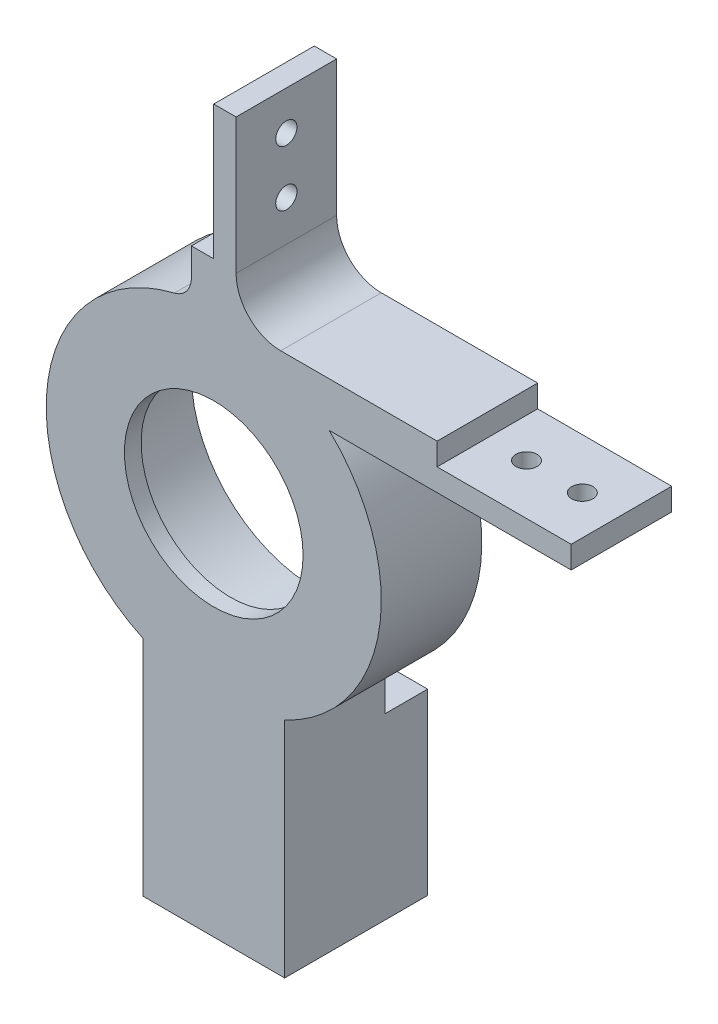
ISO-10303-21;
HEADER;
FILE_DESCRIPTION(('STEP AP214'),'2;1');
FILE_NAME('part.step','',(''),(''),'','','');
FILE_SCHEMA(('AUTOMOTIVE_DESIGN { 1 0 10303 214 1 1 1 1 }'));
ENDSEC;
DATA;
#1=APPLICATION_CONTEXT('core data for automotive mechanical design processes');
#2=APPLICATION_PROTOCOL_DEFINITION('international standard','automotive_design',2000,#1);
#3=PRODUCT_CONTEXT('',#1,'mechanical');
#4=PRODUCT('Part','Part','',(#3));
#5=PRODUCT_RELATED_PRODUCT_CATEGORY('part','',(#4));
#6=PRODUCT_DEFINITION_FORMATION('','',#4);
#7=PRODUCT_DEFINITION_CONTEXT('part definition',#1,'design');
#8=PRODUCT_DEFINITION('design','',#6,#7);
#9=PRODUCT_DEFINITION_SHAPE('','',#8);
#10=(LENGTH_UNIT() NAMED_UNIT(*) SI_UNIT(.MILLI.,.METRE.));
#11=(NAMED_UNIT(*) PLANE_ANGLE_UNIT() SI_UNIT($,.RADIAN.));
#12=(NAMED_UNIT(*) SI_UNIT($,.STERADIAN.) SOLID_ANGLE_UNIT());
#13=UNCERTAINTY_MEASURE_WITH_UNIT(LENGTH_MEASURE(1.E-05),#10,'distance_accuracy_value','');
#14=(GEOMETRIC_REPRESENTATION_CONTEXT(3) GLOBAL_UNCERTAINTY_ASSIGNED_CONTEXT((#13)) GLOBAL_UNIT_ASSIGNED_CONTEXT((#10,
#11,#12)) REPRESENTATION_CONTEXT('',''));
#15=CARTESIAN_POINT('',(0.,0.,0.));
#16=DIRECTION('',(0.,0.,1.));
#17=DIRECTION('',(1.,0.,0.));
#18=AXIS2_PLACEMENT_3D('',#15,#16,#17);
#19=CARTESIAN_POINT('',(0.,0.,9.));
#20=DIRECTION('',(0.,0.,-1.));
#21=DIRECTION('',(-1.,0.,0.));
#22=AXIS2_PLACEMENT_3D('',#19,#20,#21);
#23=CYLINDRICAL_SURFACE('',#22,15.);
#24=CARTESIAN_POINT('',(0.,0.,9.));
#25=DIRECTION('',(0.,0.,1.));
#26=DIRECTION('',(1.,0.,0.));
#27=AXIS2_PLACEMENT_3D('',#24,#25,#26);
#28=CIRCLE('',#27,15.);
#29=CARTESIAN_POINT('',(-3.52941176470588,14.5788632134044,9.));
#30=VERTEX_POINT('',#29);
#31=CARTESIAN_POINT('',(-6.35,-13.5896100017624,9.));
#32=VERTEX_POINT('',#31);
#33=EDGE_CURVE('E287',#30,#32,#28,.T.);
#34=ORIENTED_EDGE('',*,*,#33,.F.);
#35=DIRECTION('',(0.,0.,-1.));
#36=VECTOR('',#35,1.);
#37=CARTESIAN_POINT('',(-3.52941176470588,14.5788632134044,9.));
#38=LINE('',#37,#36);
#39=CARTESIAN_POINT('',(-3.52941176470588,14.5788632134044,0.));
#40=VERTEX_POINT('',#39);
#41=EDGE_CURVE('E300',#30,#40,#38,.T.);
#42=ORIENTED_EDGE('',*,*,#41,.T.);
#43=CARTESIAN_POINT('',(0.,0.,0.));
#44=DIRECTION('',(0.,0.,1.));
#45=DIRECTION('',(1.,0.,0.));
#46=AXIS2_PLACEMENT_3D('',#43,#44,#45);
#47=CIRCLE('',#46,15.);
#48=CARTESIAN_POINT('',(-6.35,-13.5896100017624,0.));
#49=VERTEX_POINT('',#48);
#50=EDGE_CURVE('E283',#40,#49,#47,.T.);
#51=ORIENTED_EDGE('',*,*,#50,.T.);
#52=DIRECTION('',(0.,0.,-1.));
#53=VECTOR('',#52,1.);
#54=CARTESIAN_POINT('',(-6.35,-13.5896100017624,9.));
#55=LINE('',#54,#53);
#56=EDGE_CURVE('E274',#32,#49,#55,.T.);
#57=ORIENTED_EDGE('',*,*,#56,.F.);
#58=EDGE_LOOP('',(#34,#42,#51,#57));
#59=FACE_BOUND('',#58,.T.);
#60=ADVANCED_FACE('F39',(#59),#23,.T.);
#61=DIRECTION('',(0.,0.,-1.));
#62=VECTOR('',#61,1.);
#63=CARTESIAN_POINT('',(10.3406261888992,10.8660687473185,9.));
#64=LINE('',#63,#62);
#65=CARTESIAN_POINT('',(10.3406261888992,10.8660687473185,9.));
#66=VERTEX_POINT('',#65);
#67=CARTESIAN_POINT('',(10.3406261888992,10.8660687473185,0.));
#68=VERTEX_POINT('',#67);
#69=EDGE_CURVE('E203',#66,#68,#64,.T.);
#70=ORIENTED_EDGE('',*,*,#69,.F.);
#71=CARTESIAN_POINT('',(6.35,-13.5896100017624,9.));
#72=VERTEX_POINT('',#71);
#73=EDGE_CURVE('E284',#72,#66,#28,.T.);
#74=ORIENTED_EDGE('',*,*,#73,.F.);
#75=DIRECTION('',(0.,0.,-1.));
#76=VECTOR('',#75,1.);
#77=CARTESIAN_POINT('',(6.35,-13.5896100017624,9.));
#78=LINE('',#77,#76);
#79=CARTESIAN_POINT('',(6.35,-13.5896100017624,0.));
#80=VERTEX_POINT('',#79);
#81=EDGE_CURVE('E277',#72,#80,#78,.T.);
#82=ORIENTED_EDGE('',*,*,#81,.T.);
#83=EDGE_CURVE('E288',#80,#68,#47,.T.);
#84=ORIENTED_EDGE('',*,*,#83,.T.);
#85=EDGE_LOOP('',(#70,#74,#82,#84));
#86=FACE_BOUND('',#85,.T.);
#87=ADVANCED_FACE('F403',(#86),#23,.T.);
#88=CARTESIAN_POINT('',(0.,0.,9.));
#89=DIRECTION('',(0.,0.,-1.));
#90=DIRECTION('',(-1.,0.,0.));
#91=AXIS2_PLACEMENT_3D('',#88,#89,#90);
#92=CYLINDRICAL_SURFACE('',#91,11.);
#93=CARTESIAN_POINT('',(0.,0.,0.));
#94=DIRECTION('',(0.,0.,1.));
#95=DIRECTION('',(1.,0.,0.));
#96=AXIS2_PLACEMENT_3D('',#93,#94,#95);
#97=CIRCLE('',#96,11.);
#98=CARTESIAN_POINT('',(11.,0.,0.));
#99=VERTEX_POINT('',#98);
#100=EDGE_CURVE('E280',#99,#99,#97,.T.);
#101=ORIENTED_EDGE('',*,*,#100,.F.);
#102=EDGE_LOOP('',(#101));
#103=FACE_BOUND('',#102,.T.);
#104=CARTESIAN_POINT('',(0.,0.,7.5));
#105=DIRECTION('',(0.,0.,1.));
#106=DIRECTION('',(1.,0.,0.));
#107=AXIS2_PLACEMENT_3D('',#104,#105,#106);
#108=CIRCLE('',#107,11.);
#109=CARTESIAN_POINT('',(11.,0.,7.5));
#110=VERTEX_POINT('',#109);
#111=EDGE_CURVE('E230',#110,#110,#108,.T.);
#112=ORIENTED_EDGE('',*,*,#111,.T.);
#113=EDGE_LOOP('',(#112));
#114=FACE_BOUND('',#113,.T.);
#115=ADVANCED_FACE('F437',(#103,#114),#92,.F.);
#116=CARTESIAN_POINT('',(0.,0.,9.));
#117=DIRECTION('',(0.,0.,1.));
#118=DIRECTION('',(1.,0.,0.));
#119=AXIS2_PLACEMENT_3D('',#116,#117,#118);
#120=PLANE('',#119);
#121=DIRECTION('',(1.,0.,0.));
#122=VECTOR('',#121,1.);
#123=CARTESIAN_POINT('',(32.,12.8660687473185,9.));
#124=LINE('',#123,#122);
#125=CARTESIAN_POINT('',(20.,12.8660687473185,9.));
#126=VERTEX_POINT('',#125);
#127=CARTESIAN_POINT('',(32.,12.8660687473185,9.));
#128=VERTEX_POINT('',#127);
#129=EDGE_CURVE('E194',#126,#128,#124,.T.);
#130=ORIENTED_EDGE('',*,*,#129,.F.);
#131=DIRECTION('',(0.,-1.,0.));
#132=VECTOR('',#131,1.);
#133=CARTESIAN_POINT('',(20.,14.8660687473185,9.));
#134=LINE('',#133,#132);
#135=CARTESIAN_POINT('',(20.,14.8660687473185,9.));
#136=VERTEX_POINT('',#135);
#137=EDGE_CURVE('E176',#136,#126,#134,.T.);
#138=ORIENTED_EDGE('',*,*,#137,.F.);
#139=DIRECTION('',(-1.,0.,0.));
#140=VECTOR('',#139,1.);
#141=CARTESIAN_POINT('',(2.00000000000001,14.8660687473185,9.));
#142=LINE('',#141,#140);
#143=CARTESIAN_POINT('',(6.00000000000001,14.8660687473185,9.));
#144=VERTEX_POINT('',#143);
#145=EDGE_CURVE('E191',#136,#144,#142,.T.);
#146=ORIENTED_EDGE('',*,*,#145,.T.);
#147=CARTESIAN_POINT('',(6.00000000000001,18.8660687473185,9.));
#148=DIRECTION('',(0.,0.,1.));
#149=DIRECTION('',(1.,0.,0.));
#150=AXIS2_PLACEMENT_3D('',#147,#148,#149);
#151=CIRCLE('',#150,4.);
#152=CARTESIAN_POINT('',(2.00000000000001,18.8660687473185,9.));
#153=VERTEX_POINT('',#152);
#154=EDGE_CURVE('E298',#144,#153,#151,.F.);
#155=ORIENTED_EDGE('',*,*,#154,.T.);
#156=DIRECTION('',(0.,1.,0.));
#157=VECTOR('',#156,1.);
#158=CARTESIAN_POINT('',(2.00000000000001,31.,9.));
#159=LINE('',#158,#157);
#160=CARTESIAN_POINT('',(2.00000000000001,31.,9.));
#161=VERTEX_POINT('',#160);
#162=EDGE_CURVE('E200',#153,#161,#159,.T.);
#163=ORIENTED_EDGE('',*,*,#162,.T.);
#164=DIRECTION('',(-1.,0.,0.));
#165=VECTOR('',#164,1.);
#166=CARTESIAN_POINT('',(-1.99999999999999,31.,9.));
#167=LINE('',#166,#165);
#168=CARTESIAN_POINT('',(0.,31.,9.));
#169=VERTEX_POINT('',#168);
#170=EDGE_CURVE('E212',#161,#169,#167,.T.);
#171=ORIENTED_EDGE('',*,*,#170,.T.);
#172=DIRECTION('',(0.,1.,0.));
#173=VECTOR('',#172,1.);
#174=CARTESIAN_POINT('',(0.,31.,9.));
#175=LINE('',#174,#173);
#176=CARTESIAN_POINT('',(0.,19.,9.));
#177=VERTEX_POINT('',#176);
#178=EDGE_CURVE('E352',#177,#169,#175,.T.);
#179=ORIENTED_EDGE('',*,*,#178,.F.);
#180=DIRECTION('',(1.,0.,0.));
#181=VECTOR('',#180,1.);
#182=CARTESIAN_POINT('',(-1.99999999999999,19.,9.));
#183=LINE('',#182,#181);
#184=CARTESIAN_POINT('',(-1.99999999999999,19.,9.));
#185=VERTEX_POINT('',#184);
#186=EDGE_CURVE('E338',#185,#177,#183,.T.);
#187=ORIENTED_EDGE('',*,*,#186,.F.);
#188=DIRECTION('',(0.,-1.,0.));
#189=VECTOR('',#188,1.);
#190=CARTESIAN_POINT('',(-1.99999999999999,31.,9.));
#191=LINE('',#190,#189);
#192=CARTESIAN_POINT('',(-1.99999999999999,16.5227116418583,9.));
#193=VERTEX_POINT('',#192);
#194=EDGE_CURVE('E210',#185,#193,#191,.T.);
#195=ORIENTED_EDGE('',*,*,#194,.T.);
#196=CARTESIAN_POINT('',(-3.99999999999999,16.5227116418583,9.));
#197=DIRECTION('',(0.,0.,1.));
#198=DIRECTION('',(1.,0.,0.));
#199=AXIS2_PLACEMENT_3D('',#196,#197,#198);
#200=CIRCLE('',#199,2.);
#201=EDGE_CURVE('E12',#193,#30,#200,.F.);
#202=ORIENTED_EDGE('',*,*,#201,.T.);
#203=ORIENTED_EDGE('',*,*,#33,.T.);
#204=DIRECTION('',(0.,-1.,0.));
#205=VECTOR('',#204,1.);
#206=CARTESIAN_POINT('',(-6.35,-13.5896100017624,9.));
#207=LINE('',#206,#205);
#208=CARTESIAN_POINT('',(-6.35,-33.5896100017624,9.));
#209=VERTEX_POINT('',#208);
#210=EDGE_CURVE('E262',#32,#209,#207,.T.);
#211=ORIENTED_EDGE('',*,*,#210,.T.);
#212=DIRECTION('',(1.,0.,0.));
#213=VECTOR('',#212,1.);
#214=CARTESIAN_POINT('',(-6.35,-33.5896100017624,9.));
#215=LINE('',#214,#213);
#216=CARTESIAN_POINT('',(6.35,-33.5896100017624,9.));
#217=VERTEX_POINT('',#216);
#218=EDGE_CURVE('E265',#209,#217,#215,.T.);
#219=ORIENTED_EDGE('',*,*,#218,.T.);
#220=DIRECTION('',(0.,1.,0.));
#221=VECTOR('',#220,1.);
#222=CARTESIAN_POINT('',(6.35,-13.5896100017624,9.));
#223=LINE('',#222,#221);
#224=EDGE_CURVE('E259',#217,#72,#223,.T.);
#225=ORIENTED_EDGE('',*,*,#224,.T.);
#226=ORIENTED_EDGE('',*,*,#73,.T.);
#227=DIRECTION('',(1.,0.,0.));
#228=VECTOR('',#227,1.);
#229=CARTESIAN_POINT('',(2.00000000000001,10.8660687473185,9.));
#230=LINE('',#229,#228);
#231=CARTESIAN_POINT('',(32.,10.8660687473185,9.));
#232=VERTEX_POINT('',#231);
#233=EDGE_CURVE('E205',#66,#232,#230,.T.);
#234=ORIENTED_EDGE('',*,*,#233,.T.);
#235=DIRECTION('',(0.,1.,0.));
#236=VECTOR('',#235,1.);
#237=CARTESIAN_POINT('',(32.,14.8660687473185,9.));
#238=LINE('',#237,#236);
#239=EDGE_CURVE('E201',#232,#128,#238,.T.);
#240=ORIENTED_EDGE('',*,*,#239,.T.);
#241=EDGE_LOOP('',(#130,#138,#146,#155,#163,#171,#179,#187,#195,#202,#203,#211,#219,#225,#226,
#234,#240));
#242=FACE_BOUND('',#241,.T.);
#243=CARTESIAN_POINT('',(0.,0.,9.));
#244=DIRECTION('',(0.,0.,1.));
#245=DIRECTION('',(1.,0.,0.));
#246=AXIS2_PLACEMENT_3D('',#243,#244,#245);
#247=CIRCLE('',#246,8.);
#248=CARTESIAN_POINT('',(8.,0.,9.));
#249=VERTEX_POINT('',#248);
#250=EDGE_CURVE('E226',#249,#249,#247,.T.);
#251=ORIENTED_EDGE('',*,*,#250,.F.);
#252=EDGE_LOOP('',(#251));
#253=FACE_BOUND('',#252,.T.);
#254=ADVANCED_FACE('F189',(#242,#253),#120,.T.);
#255=CARTESIAN_POINT('',(0.,0.,0.));
#256=DIRECTION('',(0.,0.,1.));
#257=DIRECTION('',(1.,0.,0.));
#258=AXIS2_PLACEMENT_3D('',#255,#256,#257);
#259=PLANE('',#258);
#260=CARTESIAN_POINT('',(0.,15.,0.));
#261=DIRECTION('',(0.,0.,1.));
#262=DIRECTION('',(1.,0.,0.));
#263=AXIS2_PLACEMENT_3D('',#260,#261,#262);
#264=CIRCLE('',#263,0.95);
#265=CARTESIAN_POINT('',(0.949999999999999,15.,0.));
#266=VERTEX_POINT('',#265);
#267=EDGE_CURVE('E43',#266,#266,#264,.T.);
#268=ORIENTED_EDGE('',*,*,#267,.T.);
#269=EDGE_LOOP('',(#268));
#270=FACE_BOUND('',#269,.T.);
#271=CARTESIAN_POINT('',(0.,-15.,0.));
#272=DIRECTION('',(0.,0.,1.));
#273=DIRECTION('',(1.,0.,0.));
#274=AXIS2_PLACEMENT_3D('',#271,#272,#273);
#275=CIRCLE('',#274,0.95);
#276=CARTESIAN_POINT('',(0.949999999999995,-15.,0.));
#277=VERTEX_POINT('',#276);
#278=EDGE_CURVE('E304',#277,#277,#275,.T.);
#279=ORIENTED_EDGE('',*,*,#278,.T.);
#280=EDGE_LOOP('',(#279));
#281=FACE_BOUND('',#280,.T.);
#282=DIRECTION('',(0.,-1.,0.));
#283=VECTOR('',#282,1.);
#284=CARTESIAN_POINT('',(20.,0.,0.));
#285=LINE('',#284,#283);
#286=CARTESIAN_POINT('',(20.,14.8660687473185,0.));
#287=VERTEX_POINT('',#286);
#288=CARTESIAN_POINT('',(20.,12.8660687473185,0.));
#289=VERTEX_POINT('',#288);
#290=EDGE_CURVE('E179',#287,#289,#285,.T.);
#291=ORIENTED_EDGE('',*,*,#290,.T.);
#292=DIRECTION('',(1.,0.,0.));
#293=VECTOR('',#292,1.);
#294=CARTESIAN_POINT('',(0.,12.8660687473185,0.));
#295=LINE('',#294,#293);
#296=CARTESIAN_POINT('',(32.,12.8660687473185,0.));
#297=VERTEX_POINT('',#296);
#298=EDGE_CURVE('E360',#289,#297,#295,.T.);
#299=ORIENTED_EDGE('',*,*,#298,.T.);
#300=DIRECTION('',(0.,1.,0.));
#301=VECTOR('',#300,1.);
#302=CARTESIAN_POINT('',(32.,14.8660687473185,0.));
#303=LINE('',#302,#301);
#304=CARTESIAN_POINT('',(32.,10.8660687473185,0.));
#305=VERTEX_POINT('',#304);
#306=EDGE_CURVE('E219',#305,#297,#303,.T.);
#307=ORIENTED_EDGE('',*,*,#306,.F.);
#308=DIRECTION('',(1.,0.,0.));
#309=VECTOR('',#308,1.);
#310=CARTESIAN_POINT('',(2.00000000000001,10.8660687473185,0.));
#311=LINE('',#310,#309);
#312=EDGE_CURVE('E220',#68,#305,#311,.T.);
#313=ORIENTED_EDGE('',*,*,#312,.F.);
#314=ORIENTED_EDGE('',*,*,#83,.F.);
#315=DIRECTION('',(0.,1.,0.));
#316=VECTOR('',#315,1.);
#317=CARTESIAN_POINT('',(6.35,-13.5896100017624,0.));
#318=LINE('',#317,#316);
#319=CARTESIAN_POINT('',(6.35,-17.5896100017624,0.));
#320=VERTEX_POINT('',#319);
#321=EDGE_CURVE('E258',#320,#80,#318,.T.);
#322=ORIENTED_EDGE('',*,*,#321,.F.);
#323=DIRECTION('',(-1.,0.,0.));
#324=VECTOR('',#323,1.);
#325=CARTESIAN_POINT('',(-6.35,-17.5896100017624,0.));
#326=LINE('',#325,#324);
#327=CARTESIAN_POINT('',(-6.35,-17.5896100017624,0.));
#328=VERTEX_POINT('',#327);
#329=EDGE_CURVE('E239',#320,#328,#326,.T.);
#330=ORIENTED_EDGE('',*,*,#329,.T.);
#331=DIRECTION('',(0.,-1.,0.));
#332=VECTOR('',#331,1.);
#333=CARTESIAN_POINT('',(-6.35,-13.5896100017624,0.));
#334=LINE('',#333,#332);
#335=EDGE_CURVE('E263',#49,#328,#334,.T.);
#336=ORIENTED_EDGE('',*,*,#335,.F.);
#337=ORIENTED_EDGE('',*,*,#50,.F.);
#338=CARTESIAN_POINT('',(-3.99999999999999,16.5227116418583,0.));
#339=DIRECTION('',(0.,0.,1.));
#340=DIRECTION('',(1.,0.,0.));
#341=AXIS2_PLACEMENT_3D('',#338,#339,#340);
#342=CIRCLE('',#341,2.);
#343=CARTESIAN_POINT('',(-1.99999999999999,16.5227116418583,0.));
#344=VERTEX_POINT('',#343);
#345=EDGE_CURVE('E48',#40,#344,#342,.T.);
#346=ORIENTED_EDGE('',*,*,#345,.T.);
#347=DIRECTION('',(0.,-1.,0.));
#348=VECTOR('',#347,1.);
#349=CARTESIAN_POINT('',(-1.99999999999999,31.,0.));
#350=LINE('',#349,#348);
#351=CARTESIAN_POINT('',(-1.99999999999999,19.,0.));
#352=VERTEX_POINT('',#351);
#353=EDGE_CURVE('E366',#352,#344,#350,.T.);
#354=ORIENTED_EDGE('',*,*,#353,.F.);
#355=DIRECTION('',(1.,0.,0.));
#356=VECTOR('',#355,1.);
#357=CARTESIAN_POINT('',(0.,19.,0.));
#358=LINE('',#357,#356);
#359=CARTESIAN_POINT('',(0.,19.,0.));
#360=VERTEX_POINT('',#359);
#361=EDGE_CURVE('E363',#352,#360,#358,.T.);
#362=ORIENTED_EDGE('',*,*,#361,.T.);
#363=DIRECTION('',(0.,1.,0.));
#364=VECTOR('',#363,1.);
#365=CARTESIAN_POINT('',(0.,0.,0.));
#366=LINE('',#365,#364);
#367=CARTESIAN_POINT('',(0.,31.,0.));
#368=VERTEX_POINT('',#367);
#369=EDGE_CURVE('E348',#360,#368,#366,.T.);
#370=ORIENTED_EDGE('',*,*,#369,.T.);
#371=DIRECTION('',(-1.,0.,0.));
#372=VECTOR('',#371,1.);
#373=CARTESIAN_POINT('',(-1.99999999999999,31.,0.));
#374=LINE('',#373,#372);
#375=CARTESIAN_POINT('',(2.00000000000001,31.,0.));
#376=VERTEX_POINT('',#375);
#377=EDGE_CURVE('E215',#376,#368,#374,.T.);
#378=ORIENTED_EDGE('',*,*,#377,.F.);
#379=DIRECTION('',(0.,1.,0.));
#380=VECTOR('',#379,1.);
#381=CARTESIAN_POINT('',(2.00000000000001,31.,0.));
#382=LINE('',#381,#380);
#383=CARTESIAN_POINT('',(2.00000000000001,18.8660687473185,0.));
#384=VERTEX_POINT('',#383);
#385=EDGE_CURVE('E224',#384,#376,#382,.T.);
#386=ORIENTED_EDGE('',*,*,#385,.F.);
#387=CARTESIAN_POINT('',(6.00000000000001,18.8660687473185,0.));
#388=DIRECTION('',(0.,0.,1.));
#389=DIRECTION('',(1.,0.,0.));
#390=AXIS2_PLACEMENT_3D('',#387,#388,#389);
#391=CIRCLE('',#390,4.);
#392=CARTESIAN_POINT('',(6.00000000000001,14.8660687473185,0.));
#393=VERTEX_POINT('',#392);
#394=EDGE_CURVE('E296',#384,#393,#391,.T.);
#395=ORIENTED_EDGE('',*,*,#394,.T.);
#396=DIRECTION('',(-1.,0.,0.));
#397=VECTOR('',#396,1.);
#398=CARTESIAN_POINT('',(2.00000000000001,14.8660687473185,0.));
#399=LINE('',#398,#397);
#400=EDGE_CURVE('E370',#287,#393,#399,.T.);
#401=ORIENTED_EDGE('',*,*,#400,.F.);
#402=EDGE_LOOP('',(#291,#299,#307,#313,#314,#322,#330,#336,#337,#346,#354,#362,#370,#378,#386,
#395,#401));
#403=FACE_BOUND('',#402,.T.);
#404=ORIENTED_EDGE('',*,*,#100,.T.);
#405=EDGE_LOOP('',(#404));
#406=FACE_BOUND('',#405,.T.);
#407=ADVANCED_FACE('F412',(#270,#281,#403,#406),#259,.F.);
#408=CARTESIAN_POINT('',(6.35,-13.5896100017624,9.));
#409=DIRECTION('',(-1.,0.,0.));
#410=DIRECTION('',(0.,-1.,0.));
#411=AXIS2_PLACEMENT_3D('',#408,#409,#410);
#412=PLANE('',#411);
#413=DIRECTION('',(0.,0.,-1.));
#414=VECTOR('',#413,1.);
#415=CARTESIAN_POINT('',(6.35,-33.5896100017624,9.));
#416=LINE('',#415,#414);
#417=CARTESIAN_POINT('',(6.35,-33.5896100017624,-3.80000000000001));
#418=VERTEX_POINT('',#417);
#419=EDGE_CURVE('E267',#217,#418,#416,.T.);
#420=ORIENTED_EDGE('',*,*,#419,.T.);
#421=DIRECTION('',(0.,-1.,0.));
#422=VECTOR('',#421,1.);
#423=CARTESIAN_POINT('',(6.35,-33.5896100017624,-3.8));
#424=LINE('',#423,#422);
#425=CARTESIAN_POINT('',(6.35,-17.5896100017624,-3.8));
#426=VERTEX_POINT('',#425);
#427=EDGE_CURVE('E242',#426,#418,#424,.T.);
#428=ORIENTED_EDGE('',*,*,#427,.F.);
#429=DIRECTION('',(0.,0.,1.));
#430=VECTOR('',#429,1.);
#431=CARTESIAN_POINT('',(6.35,-17.5896100017624,-37.0276773031101));
#432=LINE('',#431,#430);
#433=EDGE_CURVE('E253',#426,#320,#432,.T.);
#434=ORIENTED_EDGE('',*,*,#433,.T.);
#435=ORIENTED_EDGE('',*,*,#321,.T.);
#436=ORIENTED_EDGE('',*,*,#81,.F.);
#437=ORIENTED_EDGE('',*,*,#224,.F.);
#438=EDGE_LOOP('',(#420,#428,#434,#435,#436,#437));
#439=FACE_BOUND('',#438,.T.);
#440=ADVANCED_FACE('F398',(#439),#412,.F.);
#441=CARTESIAN_POINT('',(-6.35,-13.5896100017624,9.));
#442=DIRECTION('',(1.,0.,0.));
#443=DIRECTION('',(0.,1.,0.));
#444=AXIS2_PLACEMENT_3D('',#441,#442,#443);
#445=PLANE('',#444);
#446=ORIENTED_EDGE('',*,*,#335,.T.);
#447=DIRECTION('',(0.,0.,1.));
#448=VECTOR('',#447,1.);
#449=CARTESIAN_POINT('',(-6.35,-17.5896100017624,-37.0276773031101));
#450=LINE('',#449,#448);
#451=CARTESIAN_POINT('',(-6.35,-17.5896100017624,-3.8));
#452=VERTEX_POINT('',#451);
#453=EDGE_CURVE('E246',#452,#328,#450,.T.);
#454=ORIENTED_EDGE('',*,*,#453,.F.);
#455=DIRECTION('',(0.,1.,0.));
#456=VECTOR('',#455,1.);
#457=CARTESIAN_POINT('',(-6.35,-33.5896100017624,-3.8));
#458=LINE('',#457,#456);
#459=CARTESIAN_POINT('',(-6.35,-33.5896100017624,-3.8));
#460=VERTEX_POINT('',#459);
#461=EDGE_CURVE('E248',#460,#452,#458,.T.);
#462=ORIENTED_EDGE('',*,*,#461,.F.);
#463=DIRECTION('',(0.,0.,-1.));
#464=VECTOR('',#463,1.);
#465=CARTESIAN_POINT('',(-6.35,-33.5896100017624,9.));
#466=LINE('',#465,#464);
#467=EDGE_CURVE('E272',#209,#460,#466,.T.);
#468=ORIENTED_EDGE('',*,*,#467,.F.);
#469=ORIENTED_EDGE('',*,*,#210,.F.);
#470=ORIENTED_EDGE('',*,*,#56,.T.);
#471=EDGE_LOOP('',(#446,#454,#462,#468,#469,#470));
#472=FACE_BOUND('',#471,.T.);
#473=ADVANCED_FACE('F387',(#472),#445,.F.);
#474=CARTESIAN_POINT('',(-6.35,-33.5896100017624,9.));
#475=DIRECTION('',(0.,1.,0.));
#476=DIRECTION('',(-1.,0.,0.));
#477=AXIS2_PLACEMENT_3D('',#474,#475,#476);
#478=PLANE('',#477);
#479=CARTESIAN_POINT('',(0.,-33.5896100017624,2.59999999999999));
#480=DIRECTION('',(0.,-1.,0.));
#481=DIRECTION('',(1.,0.,0.));
#482=AXIS2_PLACEMENT_3D('',#479,#480,#481);
#483=CIRCLE('',#482,1.275);
#484=CARTESIAN_POINT('',(1.27500000000002,-33.5896100017624,2.59999999999999));
#485=VERTEX_POINT('',#484);
#486=EDGE_CURVE('E235',#485,#485,#483,.T.);
#487=ORIENTED_EDGE('',*,*,#486,.F.);
#488=EDGE_LOOP('',(#487));
#489=FACE_BOUND('',#488,.T.);
#490=ORIENTED_EDGE('',*,*,#467,.T.);
#491=DIRECTION('',(-1.,0.,0.));
#492=VECTOR('',#491,1.);
#493=CARTESIAN_POINT('',(-6.35,-33.5896100017624,-3.8));
#494=LINE('',#493,#492);
#495=EDGE_CURVE('E250',#418,#460,#494,.T.);
#496=ORIENTED_EDGE('',*,*,#495,.F.);
#497=ORIENTED_EDGE('',*,*,#419,.F.);
#498=ORIENTED_EDGE('',*,*,#218,.F.);
#499=EDGE_LOOP('',(#490,#496,#497,#498));
#500=FACE_BOUND('',#499,.T.);
#501=ADVANCED_FACE('F395',(#489,#500),#478,.F.);
#502=CARTESIAN_POINT('',(-6.35,-17.5896100017624,-37.0276773031101));
#503=DIRECTION('',(0.,1.,0.));
#504=DIRECTION('',(0.,0.,1.));
#505=AXIS2_PLACEMENT_3D('',#502,#503,#504);
#506=PLANE('',#505);
#507=DIRECTION('',(1.,0.,0.));
#508=VECTOR('',#507,1.);
#509=CARTESIAN_POINT('',(-6.35,-17.5896100017624,-3.8));
#510=LINE('',#509,#508);
#511=EDGE_CURVE('E245',#452,#426,#510,.T.);
#512=ORIENTED_EDGE('',*,*,#511,.F.);
#513=ORIENTED_EDGE('',*,*,#453,.T.);
#514=ORIENTED_EDGE('',*,*,#329,.F.);
#515=ORIENTED_EDGE('',*,*,#433,.F.);
#516=EDGE_LOOP('',(#512,#513,#514,#515));
#517=FACE_BOUND('',#516,.T.);
#518=ADVANCED_FACE('F504',(#517),#506,.T.);
#519=CARTESIAN_POINT('',(0.,0.,-3.8));
#520=DIRECTION('',(0.,0.,1.));
#521=DIRECTION('',(1.,0.,0.));
#522=AXIS2_PLACEMENT_3D('',#519,#520,#521);
#523=PLANE('',#522);
#524=ORIENTED_EDGE('',*,*,#461,.T.);
#525=ORIENTED_EDGE('',*,*,#511,.T.);
#526=ORIENTED_EDGE('',*,*,#427,.T.);
#527=ORIENTED_EDGE('',*,*,#495,.T.);
#528=EDGE_LOOP('',(#524,#525,#526,#527));
#529=FACE_BOUND('',#528,.T.);
#530=ADVANCED_FACE('F500',(#529),#523,.F.);
#531=CARTESIAN_POINT('',(0.,-26.5896100017624,2.59999999999999));
#532=DIRECTION('',(0.,-1.,0.));
#533=DIRECTION('',(1.,0.,0.));
#534=AXIS2_PLACEMENT_3D('',#531,#532,#533);
#535=CYLINDRICAL_SURFACE('',#534,1.275);
#536=CARTESIAN_POINT('',(0.,-26.5896100017624,2.59999999999999));
#537=DIRECTION('',(0.,-1.,0.));
#538=DIRECTION('',(1.,0.,0.));
#539=AXIS2_PLACEMENT_3D('',#536,#537,#538);
#540=CIRCLE('',#539,1.275);
#541=CARTESIAN_POINT('',(1.27500000000001,-26.5896100017624,2.59999999999999));
#542=VERTEX_POINT('',#541);
#543=EDGE_CURVE('E236',#542,#542,#540,.T.);
#544=ORIENTED_EDGE('',*,*,#543,.F.);
#545=EDGE_LOOP('',(#544));
#546=FACE_BOUND('',#545,.T.);
#547=ORIENTED_EDGE('',*,*,#486,.T.);
#548=EDGE_LOOP('',(#547));
#549=FACE_BOUND('',#548,.T.);
#550=ADVANCED_FACE('F496',(#546,#549),#535,.F.);
#551=CARTESIAN_POINT('',(0.,-26.5896100017624,2.59999999999999));
#552=DIRECTION('',(0.,-1.,0.));
#553=DIRECTION('',(1.,0.,0.));
#554=AXIS2_PLACEMENT_3D('',#551,#552,#553);
#555=PLANE('',#554);
#556=ORIENTED_EDGE('',*,*,#543,.T.);
#557=EDGE_LOOP('',(#556));
#558=FACE_BOUND('',#557,.T.);
#559=ADVANCED_FACE('F492',(#558),#555,.T.);
#560=CARTESIAN_POINT('',(0.,0.,7.5));
#561=DIRECTION('',(0.,0.,1.));
#562=DIRECTION('',(1.,0.,0.));
#563=AXIS2_PLACEMENT_3D('',#560,#561,#562);
#564=PLANE('',#563);
#565=CARTESIAN_POINT('',(0.,0.,7.5));
#566=DIRECTION('',(0.,0.,1.));
#567=DIRECTION('',(1.,0.,0.));
#568=AXIS2_PLACEMENT_3D('',#565,#566,#567);
#569=CIRCLE('',#568,8.);
#570=CARTESIAN_POINT('',(8.,0.,7.5));
#571=VERTEX_POINT('',#570);
#572=EDGE_CURVE('E227',#571,#571,#569,.T.);
#573=ORIENTED_EDGE('',*,*,#572,.T.);
#574=EDGE_LOOP('',(#573));
#575=FACE_BOUND('',#574,.T.);
#576=ORIENTED_EDGE('',*,*,#111,.F.);
#577=EDGE_LOOP('',(#576));
#578=FACE_BOUND('',#577,.T.);
#579=ADVANCED_FACE('F488',(#575,#578),#564,.F.);
#580=CARTESIAN_POINT('',(0.,0.,7.5));
#581=DIRECTION('',(0.,0.,1.));
#582=DIRECTION('',(1.,0.,0.));
#583=AXIS2_PLACEMENT_3D('',#580,#581,#582);
#584=CYLINDRICAL_SURFACE('',#583,8.);
#585=ORIENTED_EDGE('',*,*,#572,.F.);
#586=EDGE_LOOP('',(#585));
#587=FACE_BOUND('',#586,.T.);
#588=ORIENTED_EDGE('',*,*,#250,.T.);
#589=EDGE_LOOP('',(#588));
#590=FACE_BOUND('',#589,.T.);
#591=ADVANCED_FACE('F482',(#587,#590),#584,.F.);
#592=CARTESIAN_POINT('',(2.00000000000001,10.8660687473185,48.5142403152042));
#593=DIRECTION('',(0.,1.,0.));
#594=DIRECTION('',(0.,0.,1.));
#595=AXIS2_PLACEMENT_3D('',#592,#593,#594);
#596=PLANE('',#595);
#597=CARTESIAN_POINT('',(23.5,10.8660687473185,4.5));
#598=DIRECTION('',(0.,1.,0.));
#599=DIRECTION('',(0.,0.,1.));
#600=AXIS2_PLACEMENT_3D('',#597,#598,#599);
#601=CIRCLE('',#600,0.950000000000001);
#602=CARTESIAN_POINT('',(23.5,10.8660687473185,5.45));
#603=VERTEX_POINT('',#602);
#604=EDGE_CURVE('E322',#603,#603,#601,.F.);
#605=ORIENTED_EDGE('',*,*,#604,.F.);
#606=EDGE_LOOP('',(#605));
#607=FACE_BOUND('',#606,.T.);
#608=CARTESIAN_POINT('',(28.5,10.8660687473185,4.5));
#609=DIRECTION('',(0.,1.,0.));
#610=DIRECTION('',(0.,0.,1.));
#611=AXIS2_PLACEMENT_3D('',#608,#609,#610);
#612=CIRCLE('',#611,0.950000000000004);
#613=CARTESIAN_POINT('',(28.5,10.8660687473185,5.45000000000001));
#614=VERTEX_POINT('',#613);
#615=EDGE_CURVE('E323',#614,#614,#612,.F.);
#616=ORIENTED_EDGE('',*,*,#615,.F.);
#617=EDGE_LOOP('',(#616));
#618=FACE_BOUND('',#617,.T.);
#619=ORIENTED_EDGE('',*,*,#233,.F.);
#620=ORIENTED_EDGE('',*,*,#69,.T.);
#621=ORIENTED_EDGE('',*,*,#312,.T.);
#622=DIRECTION('',(0.,0.,-1.));
#623=VECTOR('',#622,1.);
#624=CARTESIAN_POINT('',(32.,10.8660687473185,48.5142403152042));
#625=LINE('',#624,#623);
#626=EDGE_CURVE('E216',#232,#305,#625,.T.);
#627=ORIENTED_EDGE('',*,*,#626,.F.);
#628=EDGE_LOOP('',(#619,#620,#621,#627));
#629=FACE_BOUND('',#628,.T.);
#630=ADVANCED_FACE('F410',(#607,#618,#629),#596,.F.);
#631=CARTESIAN_POINT('',(-1.99999999999999,31.,48.5142403152042));
#632=DIRECTION('',(1.,0.,0.));
#633=DIRECTION('',(0.,1.,0.));
#634=AXIS2_PLACEMENT_3D('',#631,#632,#633);
#635=PLANE('',#634);
#636=ORIENTED_EDGE('',*,*,#353,.T.);
#637=DIRECTION('',(0.,0.,1.));
#638=VECTOR('',#637,1.);
#639=CARTESIAN_POINT('',(-1.99999999999999,16.5227116418583,9.));
#640=LINE('',#639,#638);
#641=EDGE_CURVE('E62',#344,#193,#640,.T.);
#642=ORIENTED_EDGE('',*,*,#641,.T.);
#643=ORIENTED_EDGE('',*,*,#194,.F.);
#644=DIRECTION('',(0.,0.,1.));
#645=VECTOR('',#644,1.);
#646=CARTESIAN_POINT('',(-1.99999999999999,19.,-3.80000000000001));
#647=LINE('',#646,#645);
#648=EDGE_CURVE('E354',#352,#185,#647,.T.);
#649=ORIENTED_EDGE('',*,*,#648,.F.);
#650=EDGE_LOOP('',(#636,#642,#643,#649));
#651=FACE_BOUND('',#650,.T.);
#652=ADVANCED_FACE('F375',(#651),#635,.F.);
#653=CARTESIAN_POINT('',(32.,14.8660687473185,48.5142403152042));
#654=DIRECTION('',(-1.,0.,0.));
#655=DIRECTION('',(0.,0.,1.));
#656=AXIS2_PLACEMENT_3D('',#653,#654,#655);
#657=PLANE('',#656);
#658=ORIENTED_EDGE('',*,*,#306,.T.);
#659=DIRECTION('',(0.,0.,1.));
#660=VECTOR('',#659,1.);
#661=CARTESIAN_POINT('',(32.,12.8660687473185,-3.80000000000001));
#662=LINE('',#661,#660);
#663=EDGE_CURVE('E345',#297,#128,#662,.T.);
#664=ORIENTED_EDGE('',*,*,#663,.T.);
#665=ORIENTED_EDGE('',*,*,#239,.F.);
#666=ORIENTED_EDGE('',*,*,#626,.T.);
#667=EDGE_LOOP('',(#658,#664,#665,#666));
#668=FACE_BOUND('',#667,.T.);
#669=ADVANCED_FACE('F408',(#668),#657,.F.);
#670=CARTESIAN_POINT('',(2.00000000000001,14.8660687473185,48.5142403152042));
#671=DIRECTION('',(0.,-1.,0.));
#672=DIRECTION('',(0.,0.,-1.));
#673=AXIS2_PLACEMENT_3D('',#670,#671,#672);
#674=PLANE('',#673);
#675=ORIENTED_EDGE('',*,*,#400,.T.);
#676=DIRECTION('',(0.,0.,-1.));
#677=VECTOR('',#676,1.);
#678=CARTESIAN_POINT('',(6.00000000000001,14.8660687473185,9.));
#679=LINE('',#678,#677);
#680=EDGE_CURVE('E199',#393,#144,#679,.F.);
#681=ORIENTED_EDGE('',*,*,#680,.T.);
#682=ORIENTED_EDGE('',*,*,#145,.F.);
#683=DIRECTION('',(0.,0.,-1.));
#684=VECTOR('',#683,1.);
#685=CARTESIAN_POINT('',(20.,14.8660687473185,48.5142403152042));
#686=LINE('',#685,#684);
#687=EDGE_CURVE('E172',#136,#287,#686,.T.);
#688=ORIENTED_EDGE('',*,*,#687,.T.);
#689=EDGE_LOOP('',(#675,#681,#682,#688));
#690=FACE_BOUND('',#689,.T.);
#691=ADVANCED_FACE('F197',(#690),#674,.F.);
#692=CARTESIAN_POINT('',(2.00000000000001,31.,48.5142403152042));
#693=DIRECTION('',(-1.,0.,0.));
#694=DIRECTION('',(0.,-1.,0.));
#695=AXIS2_PLACEMENT_3D('',#692,#693,#694);
#696=PLANE('',#695);
#697=CARTESIAN_POINT('',(2.00000000000001,27.5,4.5));
#698=DIRECTION('',(-1.,0.,0.));
#699=DIRECTION('',(0.,-1.,0.));
#700=AXIS2_PLACEMENT_3D('',#697,#698,#699);
#701=CIRCLE('',#700,0.949999999999999);
#702=CARTESIAN_POINT('',(2.00000000000001,26.55,4.5));
#703=VERTEX_POINT('',#702);
#704=EDGE_CURVE('E334',#703,#703,#701,.F.);
#705=ORIENTED_EDGE('',*,*,#704,.F.);
#706=EDGE_LOOP('',(#705));
#707=FACE_BOUND('',#706,.T.);
#708=CARTESIAN_POINT('',(2.00000000000001,22.5,4.5));
#709=DIRECTION('',(-1.,0.,0.));
#710=DIRECTION('',(0.,-1.,0.));
#711=AXIS2_PLACEMENT_3D('',#708,#709,#710);
#712=CIRCLE('',#711,0.95);
#713=CARTESIAN_POINT('',(2.00000000000001,21.55,4.5));
#714=VERTEX_POINT('',#713);
#715=EDGE_CURVE('E335',#714,#714,#712,.F.);
#716=ORIENTED_EDGE('',*,*,#715,.F.);
#717=EDGE_LOOP('',(#716));
#718=FACE_BOUND('',#717,.T.);
#719=ORIENTED_EDGE('',*,*,#162,.F.);
#720=DIRECTION('',(0.,0.,-1.));
#721=VECTOR('',#720,1.);
#722=CARTESIAN_POINT('',(2.00000000000001,18.8660687473185,0.));
#723=LINE('',#722,#721);
#724=EDGE_CURVE('E184',#153,#384,#723,.T.);
#725=ORIENTED_EDGE('',*,*,#724,.T.);
#726=ORIENTED_EDGE('',*,*,#385,.T.);
#727=DIRECTION('',(0.,0.,-1.));
#728=VECTOR('',#727,1.);
#729=CARTESIAN_POINT('',(2.00000000000001,31.,48.5142403152042));
#730=LINE('',#729,#728);
#731=EDGE_CURVE('E221',#161,#376,#730,.T.);
#732=ORIENTED_EDGE('',*,*,#731,.F.);
#733=EDGE_LOOP('',(#719,#725,#726,#732));
#734=FACE_BOUND('',#733,.T.);
#735=ADVANCED_FACE('F456',(#707,#718,#734),#696,.F.);
#736=CARTESIAN_POINT('',(-1.99999999999999,31.,48.5142403152042));
#737=DIRECTION('',(0.,-1.,0.));
#738=DIRECTION('',(0.,0.,-1.));
#739=AXIS2_PLACEMENT_3D('',#736,#737,#738);
#740=PLANE('',#739);
#741=ORIENTED_EDGE('',*,*,#377,.T.);
#742=DIRECTION('',(0.,0.,1.));
#743=VECTOR('',#742,1.);
#744=CARTESIAN_POINT('',(0.,31.,48.5142403152042));
#745=LINE('',#744,#743);
#746=EDGE_CURVE('E185',#368,#169,#745,.T.);
#747=ORIENTED_EDGE('',*,*,#746,.T.);
#748=ORIENTED_EDGE('',*,*,#170,.F.);
#749=ORIENTED_EDGE('',*,*,#731,.T.);
#750=EDGE_LOOP('',(#741,#747,#748,#749));
#751=FACE_BOUND('',#750,.T.);
#752=ADVANCED_FACE('F461',(#751),#740,.F.);
#753=CARTESIAN_POINT('',(-1.99999999999999,19.,-3.80000000000001));
#754=DIRECTION('',(0.,-1.,0.));
#755=DIRECTION('',(0.,0.,-1.));
#756=AXIS2_PLACEMENT_3D('',#753,#754,#755);
#757=PLANE('',#756);
#758=ORIENTED_EDGE('',*,*,#648,.T.);
#759=ORIENTED_EDGE('',*,*,#186,.T.);
#760=DIRECTION('',(0.,0.,1.));
#761=VECTOR('',#760,1.);
#762=CARTESIAN_POINT('',(0.,19.,-3.80000000000001));
#763=LINE('',#762,#761);
#764=EDGE_CURVE('E195',#360,#177,#763,.T.);
#765=ORIENTED_EDGE('',*,*,#764,.F.);
#766=ORIENTED_EDGE('',*,*,#361,.F.);
#767=EDGE_LOOP('',(#758,#759,#765,#766));
#768=FACE_BOUND('',#767,.T.);
#769=ADVANCED_FACE('F426',(#768),#757,.F.);
#770=CARTESIAN_POINT('',(0.,31.,-3.80000000000001));
#771=DIRECTION('',(1.,0.,0.));
#772=DIRECTION('',(0.,1.,0.));
#773=AXIS2_PLACEMENT_3D('',#770,#771,#772);
#774=PLANE('',#773);
#775=CARTESIAN_POINT('',(0.,27.5,4.5));
#776=DIRECTION('',(-1.,0.,0.));
#777=DIRECTION('',(0.,-1.,0.));
#778=AXIS2_PLACEMENT_3D('',#775,#776,#777);
#779=CIRCLE('',#778,0.949999999999999);
#780=CARTESIAN_POINT('',(0.,26.55,4.5));
#781=VERTEX_POINT('',#780);
#782=EDGE_CURVE('E331',#781,#781,#779,.T.);
#783=ORIENTED_EDGE('',*,*,#782,.F.);
#784=EDGE_LOOP('',(#783));
#785=FACE_BOUND('',#784,.T.);
#786=CARTESIAN_POINT('',(0.,22.5,4.5));
#787=DIRECTION('',(-1.,0.,0.));
#788=DIRECTION('',(0.,-1.,0.));
#789=AXIS2_PLACEMENT_3D('',#786,#787,#788);
#790=CIRCLE('',#789,0.95);
#791=CARTESIAN_POINT('',(0.,21.55,4.5));
#792=VERTEX_POINT('',#791);
#793=EDGE_CURVE('E326',#792,#792,#790,.T.);
#794=ORIENTED_EDGE('',*,*,#793,.F.);
#795=EDGE_LOOP('',(#794));
#796=FACE_BOUND('',#795,.T.);
#797=ORIENTED_EDGE('',*,*,#764,.T.);
#798=ORIENTED_EDGE('',*,*,#178,.T.);
#799=ORIENTED_EDGE('',*,*,#746,.F.);
#800=ORIENTED_EDGE('',*,*,#369,.F.);
#801=EDGE_LOOP('',(#797,#798,#799,#800));
#802=FACE_BOUND('',#801,.T.);
#803=ADVANCED_FACE('F417',(#785,#796,#802),#774,.F.);
#804=CARTESIAN_POINT('',(32.,12.8660687473185,-3.80000000000001));
#805=DIRECTION('',(0.,-1.,0.));
#806=DIRECTION('',(1.,0.,0.));
#807=AXIS2_PLACEMENT_3D('',#804,#805,#806);
#808=PLANE('',#807);
#809=CARTESIAN_POINT('',(23.5,12.8660687473185,4.5));
#810=DIRECTION('',(0.,1.,0.));
#811=DIRECTION('',(-1.,0.,0.));
#812=AXIS2_PLACEMENT_3D('',#809,#810,#811);
#813=CIRCLE('',#812,0.950000000000001);
#814=CARTESIAN_POINT('',(22.55,12.8660687473185,4.5));
#815=VERTEX_POINT('',#814);
#816=EDGE_CURVE('E319',#815,#815,#813,.T.);
#817=ORIENTED_EDGE('',*,*,#816,.F.);
#818=EDGE_LOOP('',(#817));
#819=FACE_BOUND('',#818,.T.);
#820=CARTESIAN_POINT('',(28.5,12.8660687473185,4.5));
#821=DIRECTION('',(0.,1.,0.));
#822=DIRECTION('',(-1.,0.,0.));
#823=AXIS2_PLACEMENT_3D('',#820,#821,#822);
#824=CIRCLE('',#823,0.950000000000004);
#825=CARTESIAN_POINT('',(27.55,12.8660687473185,4.5));
#826=VERTEX_POINT('',#825);
#827=EDGE_CURVE('E310',#826,#826,#824,.T.);
#828=ORIENTED_EDGE('',*,*,#827,.F.);
#829=EDGE_LOOP('',(#828));
#830=FACE_BOUND('',#829,.T.);
#831=DIRECTION('',(0.,0.,1.));
#832=VECTOR('',#831,1.);
#833=CARTESIAN_POINT('',(20.,12.8660687473185,-3.80000000000001));
#834=LINE('',#833,#832);
#835=EDGE_CURVE('E344',#289,#126,#834,.T.);
#836=ORIENTED_EDGE('',*,*,#835,.T.);
#837=ORIENTED_EDGE('',*,*,#129,.T.);
#838=ORIENTED_EDGE('',*,*,#663,.F.);
#839=ORIENTED_EDGE('',*,*,#298,.F.);
#840=EDGE_LOOP('',(#836,#837,#838,#839));
#841=FACE_BOUND('',#840,.T.);
#842=ADVANCED_FACE('F415',(#819,#830,#841),#808,.F.);
#843=CARTESIAN_POINT('',(20.,14.8660687473185,-3.80000000000001));
#844=DIRECTION('',(-1.,0.,0.));
#845=DIRECTION('',(0.,0.,1.));
#846=AXIS2_PLACEMENT_3D('',#843,#844,#845);
#847=PLANE('',#846);
#848=ORIENTED_EDGE('',*,*,#687,.F.);
#849=ORIENTED_EDGE('',*,*,#137,.T.);
#850=ORIENTED_EDGE('',*,*,#835,.F.);
#851=ORIENTED_EDGE('',*,*,#290,.F.);
#852=EDGE_LOOP('',(#848,#849,#850,#851));
#853=FACE_BOUND('',#852,.T.);
#854=ADVANCED_FACE('F174',(#853),#847,.F.);
#855=CARTESIAN_POINT('',(32.001,22.5,4.5));
#856=DIRECTION('',(-1.,0.,0.));
#857=DIRECTION('',(0.,-1.,0.));
#858=AXIS2_PLACEMENT_3D('',#855,#856,#857);
#859=CYLINDRICAL_SURFACE('',#858,0.95);
#860=ORIENTED_EDGE('',*,*,#793,.T.);
#861=EDGE_LOOP('',(#860));
#862=FACE_BOUND('',#861,.T.);
#863=ORIENTED_EDGE('',*,*,#715,.T.);
#864=EDGE_LOOP('',(#863));
#865=FACE_BOUND('',#864,.T.);
#866=ADVANCED_FACE('F424',(#862,#865),#859,.F.);
#867=CARTESIAN_POINT('',(32.001,27.5,4.5));
#868=DIRECTION('',(-1.,0.,0.));
#869=DIRECTION('',(0.,-1.,0.));
#870=AXIS2_PLACEMENT_3D('',#867,#868,#869);
#871=CYLINDRICAL_SURFACE('',#870,0.949999999999999);
#872=ORIENTED_EDGE('',*,*,#782,.T.);
#873=EDGE_LOOP('',(#872));
#874=FACE_BOUND('',#873,.T.);
#875=ORIENTED_EDGE('',*,*,#704,.T.);
#876=EDGE_LOOP('',(#875));
#877=FACE_BOUND('',#876,.T.);
#878=ADVANCED_FACE('F546',(#874,#877),#871,.F.);
#879=CARTESIAN_POINT('',(28.5,-33.5906100017624,4.5));
#880=DIRECTION('',(0.,1.,0.));
#881=DIRECTION('',(-1.,0.,0.));
#882=AXIS2_PLACEMENT_3D('',#879,#880,#881);
#883=CYLINDRICAL_SURFACE('',#882,0.950000000000004);
#884=ORIENTED_EDGE('',*,*,#827,.T.);
#885=EDGE_LOOP('',(#884));
#886=FACE_BOUND('',#885,.T.);
#887=ORIENTED_EDGE('',*,*,#615,.T.);
#888=EDGE_LOOP('',(#887));
#889=FACE_BOUND('',#888,.T.);
#890=ADVANCED_FACE('F449',(#886,#889),#883,.F.);
#891=CARTESIAN_POINT('',(23.5,-33.5906100017624,4.5));
#892=DIRECTION('',(0.,1.,0.));
#893=DIRECTION('',(-1.,0.,0.));
#894=AXIS2_PLACEMENT_3D('',#891,#892,#893);
#895=CYLINDRICAL_SURFACE('',#894,0.950000000000001);
#896=ORIENTED_EDGE('',*,*,#816,.T.);
#897=EDGE_LOOP('',(#896));
#898=FACE_BOUND('',#897,.T.);
#899=ORIENTED_EDGE('',*,*,#604,.T.);
#900=EDGE_LOOP('',(#899));
#901=FACE_BOUND('',#900,.T.);
#902=ADVANCED_FACE('F442',(#898,#901),#895,.F.);
#903=CARTESIAN_POINT('',(6.00000000000001,18.8660687473185,48.5142403152042));
#904=DIRECTION('',(0.,0.,1.));
#905=DIRECTION('',(1.,0.,0.));
#906=AXIS2_PLACEMENT_3D('',#903,#904,#905);
#907=CYLINDRICAL_SURFACE('',#906,4.);
#908=ORIENTED_EDGE('',*,*,#154,.F.);
#909=ORIENTED_EDGE('',*,*,#680,.F.);
#910=ORIENTED_EDGE('',*,*,#394,.F.);
#911=ORIENTED_EDGE('',*,*,#724,.F.);
#912=EDGE_LOOP('',(#908,#909,#910,#911));
#913=FACE_BOUND('',#912,.T.);
#914=ADVANCED_FACE('F440',(#913),#907,.F.);
#915=CARTESIAN_POINT('',(-3.99999999999999,16.5227116418583,9.));
#916=DIRECTION('',(0.,0.,-1.));
#917=DIRECTION('',(-1.,0.,0.));
#918=AXIS2_PLACEMENT_3D('',#915,#916,#917);
#919=CYLINDRICAL_SURFACE('',#918,2.);
#920=ORIENTED_EDGE('',*,*,#201,.F.);
#921=ORIENTED_EDGE('',*,*,#641,.F.);
#922=ORIENTED_EDGE('',*,*,#345,.F.);
#923=ORIENTED_EDGE('',*,*,#41,.F.);
#924=EDGE_LOOP('',(#920,#921,#922,#923));
#925=FACE_BOUND('',#924,.T.);
#926=ADVANCED_FACE('F41',(#925),#919,.F.);
#927=CARTESIAN_POINT('',(0.,-15.,7.5));
#928=DIRECTION('',(0.,0.,-1.));
#929=DIRECTION('',(-1.,0.,0.));
#930=AXIS2_PLACEMENT_3D('',#927,#928,#929);
#931=CYLINDRICAL_SURFACE('',#930,0.95);
#932=CARTESIAN_POINT('',(0.,-15.,7.5));
#933=DIRECTION('',(0.,0.,-1.));
#934=DIRECTION('',(-1.,0.,0.));
#935=AXIS2_PLACEMENT_3D('',#932,#933,#934);
#936=CIRCLE('',#935,0.95);
#937=CARTESIAN_POINT('',(-0.950000000000004,-15.,7.5));
#938=VERTEX_POINT('',#937);
#939=EDGE_CURVE('E312',#938,#938,#936,.T.);
#940=ORIENTED_EDGE('',*,*,#939,.F.);
#941=EDGE_LOOP('',(#940));
#942=FACE_BOUND('',#941,.T.);
#943=ORIENTED_EDGE('',*,*,#278,.F.);
#944=EDGE_LOOP('',(#943));
#945=FACE_BOUND('',#944,.T.);
#946=ADVANCED_FACE('F448',(#942,#945),#931,.F.);
#947=CARTESIAN_POINT('',(0.,-15.,7.5));
#948=DIRECTION('',(0.,0.,-1.));
#949=DIRECTION('',(-1.,0.,0.));
#950=AXIS2_PLACEMENT_3D('',#947,#948,#949);
#951=PLANE('',#950);
#952=ORIENTED_EDGE('',*,*,#939,.T.);
#953=EDGE_LOOP('',(#952));
#954=FACE_BOUND('',#953,.T.);
#955=ADVANCED_FACE('F530',(#954),#951,.T.);
#956=CARTESIAN_POINT('',(0.,15.,7.5));
#957=DIRECTION('',(0.,0.,-1.));
#958=DIRECTION('',(-1.,0.,0.));
#959=AXIS2_PLACEMENT_3D('',#956,#957,#958);
#960=CYLINDRICAL_SURFACE('',#959,0.95);
#961=CARTESIAN_POINT('',(0.,15.,7.5));
#962=DIRECTION('',(0.,0.,-1.));
#963=DIRECTION('',(-1.,0.,0.));
#964=AXIS2_PLACEMENT_3D('',#961,#962,#963);
#965=CIRCLE('',#964,0.95);
#966=CARTESIAN_POINT('',(-0.95,15.,7.5));
#967=VERTEX_POINT('',#966);
#968=EDGE_CURVE('E306',#967,#967,#965,.T.);
#969=ORIENTED_EDGE('',*,*,#968,.F.);
#970=EDGE_LOOP('',(#969));
#971=FACE_BOUND('',#970,.T.);
#972=ORIENTED_EDGE('',*,*,#267,.F.);
#973=EDGE_LOOP('',(#972));
#974=FACE_BOUND('',#973,.T.);
#975=ADVANCED_FACE('F527',(#971,#974),#960,.F.);
#976=CARTESIAN_POINT('',(0.,15.,7.5));
#977=DIRECTION('',(0.,0.,-1.));
#978=DIRECTION('',(-1.,0.,0.));
#979=AXIS2_PLACEMENT_3D('',#976,#977,#978);
#980=PLANE('',#979);
#981=ORIENTED_EDGE('',*,*,#968,.T.);
#982=EDGE_LOOP('',(#981));
#983=FACE_BOUND('',#982,.T.);
#984=ADVANCED_FACE('F529',(#983),#980,.T.);
#985=CLOSED_SHELL('',(#60,#87,#115,#254,#407,#440,#473,#501,#518,#530,#550,#559,#579,#591,#630,
#652,#669,#691,#735,#752,#769,#803,#842,#854,#866,#878,#890,#902,#914,#926,#946,#955,#975,#984));
#986=MANIFOLD_SOLID_BREP('B2',#985);
#987=ADVANCED_BREP_SHAPE_REPRESENTATION('',(#18,#986),#14);
#988=SHAPE_DEFINITION_REPRESENTATION(#9,#987);
ENDSEC;
END-ISO-10303-21;
